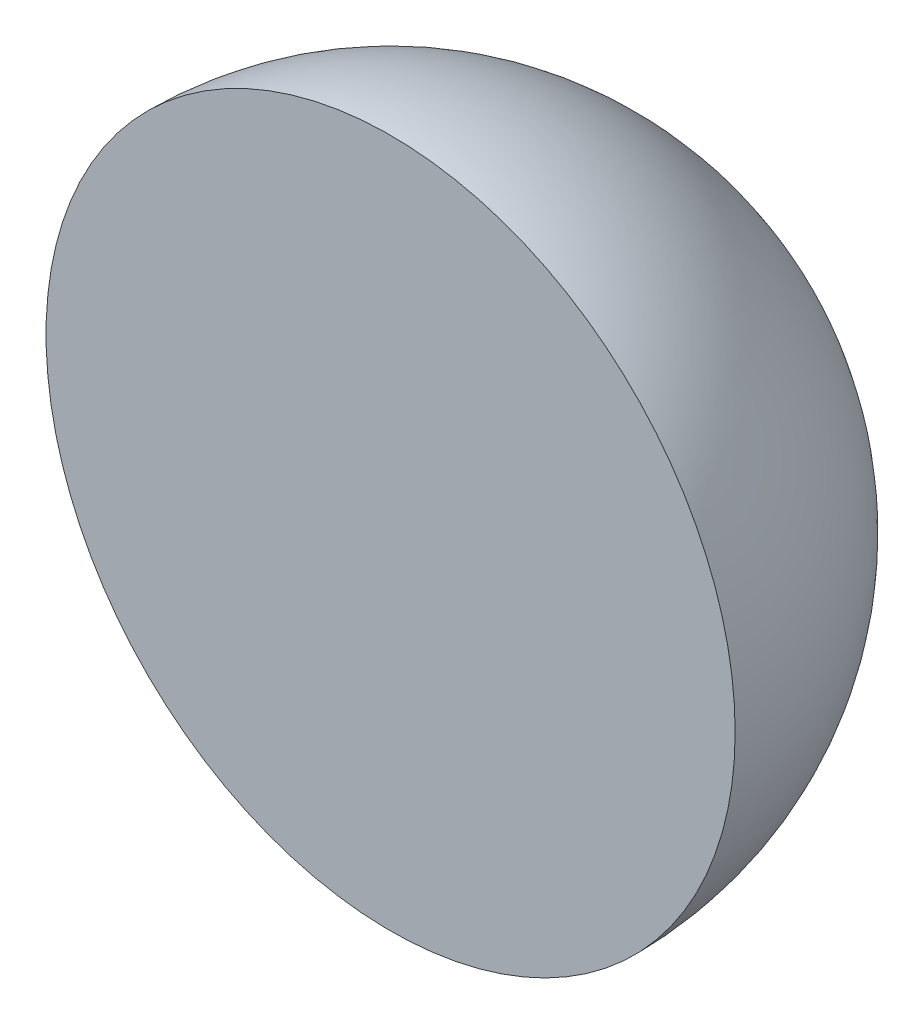
ISO-10303-21;
HEADER;
FILE_DESCRIPTION(('STEP AP214'),'2;1');
FILE_NAME('part.step','',(''),(''),'','','');
FILE_SCHEMA(('AUTOMOTIVE_DESIGN { 1 0 10303 214 1 1 1 1 }'));
ENDSEC;
DATA;
#1=APPLICATION_CONTEXT('core data for automotive mechanical design processes');
#2=APPLICATION_PROTOCOL_DEFINITION('international standard','automotive_design',2000,#1);
#3=PRODUCT_CONTEXT('',#1,'mechanical');
#4=PRODUCT('Part','Part','',(#3));
#5=PRODUCT_RELATED_PRODUCT_CATEGORY('part','',(#4));
#6=PRODUCT_DEFINITION_FORMATION('','',#4);
#7=PRODUCT_DEFINITION_CONTEXT('part definition',#1,'design');
#8=PRODUCT_DEFINITION('design','',#6,#7);
#9=PRODUCT_DEFINITION_SHAPE('','',#8);
#10=(LENGTH_UNIT() NAMED_UNIT(*) SI_UNIT(.MILLI.,.METRE.));
#11=(NAMED_UNIT(*) PLANE_ANGLE_UNIT() SI_UNIT($,.RADIAN.));
#12=(NAMED_UNIT(*) SI_UNIT($,.STERADIAN.) SOLID_ANGLE_UNIT());
#13=UNCERTAINTY_MEASURE_WITH_UNIT(LENGTH_MEASURE(1.E-05),#10,'distance_accuracy_value','');
#14=(GEOMETRIC_REPRESENTATION_CONTEXT(3) GLOBAL_UNCERTAINTY_ASSIGNED_CONTEXT((#13)) GLOBAL_UNIT_ASSIGNED_CONTEXT((#10,
#11,#12)) REPRESENTATION_CONTEXT('',''));
#15=CARTESIAN_POINT('',(0.,0.,0.));
#16=DIRECTION('',(0.,0.,1.));
#17=DIRECTION('',(1.,0.,0.));
#18=AXIS2_PLACEMENT_3D('',#15,#16,#17);
#19=CARTESIAN_POINT('',(0.,0.,0.));
#20=DIRECTION('',(0.,0.,1.));
#21=DIRECTION('',(1.,0.,0.));
#22=AXIS2_PLACEMENT_3D('',#19,#20,#21);
#23=PLANE('',#22);
#24=CARTESIAN_POINT('',(0.,0.,0.));
#25=DIRECTION('',(0.,0.,1.));
#26=DIRECTION('',(1.,0.,0.));
#27=AXIS2_PLACEMENT_3D('',#24,#25,#26);
#28=CIRCLE('',#27,31.5);
#29=CARTESIAN_POINT('',(31.5,0.,0.));
#30=VERTEX_POINT('',#29);
#31=EDGE_CURVE('E10',#30,#30,#28,.T.);
#32=ORIENTED_EDGE('',*,*,#31,.T.);
#33=EDGE_LOOP('',(#32));
#34=FACE_BOUND('',#33,.T.);
#35=ADVANCED_FACE('F35',(#34),#23,.T.);
#36=CARTESIAN_POINT('',(0.,0.,0.));
#37=DIRECTION('',(0.,0.,1.));
#38=DIRECTION('',(1.,0.,0.));
#39=AXIS2_PLACEMENT_3D('',#36,#37,#38);
#40=SPHERICAL_SURFACE('',#39,31.5);
#41=ORIENTED_EDGE('',*,*,#31,.F.);
#42=EDGE_LOOP('',(#41));
#43=FACE_BOUND('',#42,.T.);
#44=ADVANCED_FACE('F44',(#43),#40,.T.);
#45=CLOSED_SHELL('',(#35,#44));
#46=MANIFOLD_SOLID_BREP('B2',#45);
#47=ADVANCED_BREP_SHAPE_REPRESENTATION('',(#18,#46),#14);
#48=SHAPE_DEFINITION_REPRESENTATION(#9,#47);
ENDSEC;
END-ISO-10303-21;
